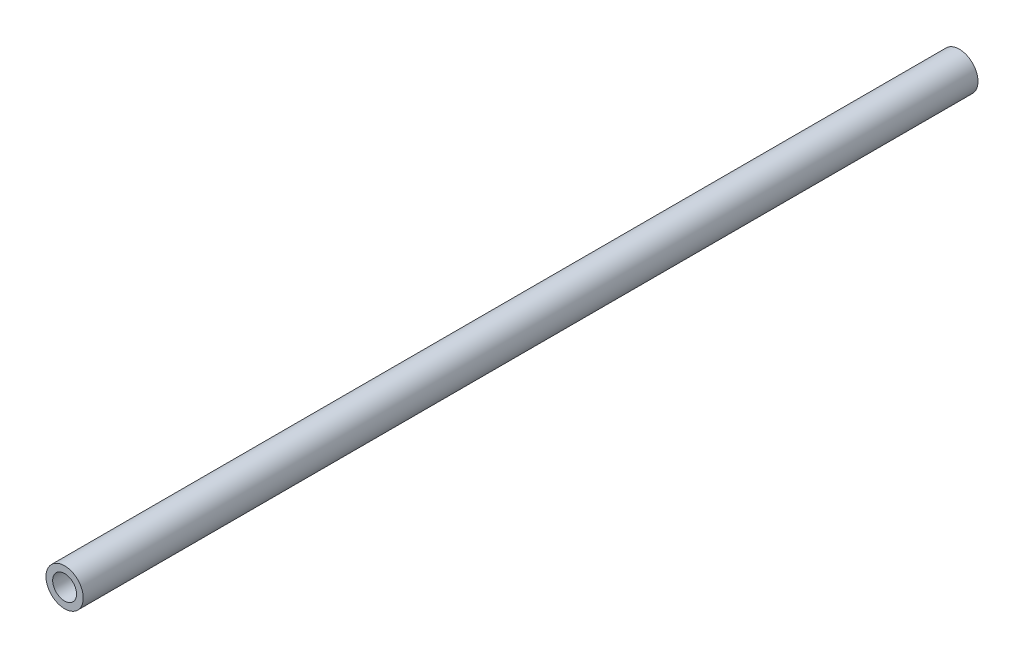
ISO-10303-21;
HEADER;
FILE_DESCRIPTION(('STEP AP214'),'2;1');
FILE_NAME('part.step','',(''),(''),'','','');
FILE_SCHEMA(('AUTOMOTIVE_DESIGN { 1 0 10303 214 1 1 1 1 }'));
ENDSEC;
DATA;
#1=APPLICATION_CONTEXT('core data for automotive mechanical design processes');
#2=APPLICATION_PROTOCOL_DEFINITION('international standard','automotive_design',2000,#1);
#3=PRODUCT_CONTEXT('',#1,'mechanical');
#4=PRODUCT('Part','Part','',(#3));
#5=PRODUCT_RELATED_PRODUCT_CATEGORY('part','',(#4));
#6=PRODUCT_DEFINITION_FORMATION('','',#4);
#7=PRODUCT_DEFINITION_CONTEXT('part definition',#1,'design');
#8=PRODUCT_DEFINITION('design','',#6,#7);
#9=PRODUCT_DEFINITION_SHAPE('','',#8);
#10=(LENGTH_UNIT() NAMED_UNIT(*) SI_UNIT(.MILLI.,.METRE.));
#11=(NAMED_UNIT(*) PLANE_ANGLE_UNIT() SI_UNIT($,.RADIAN.));
#12=(NAMED_UNIT(*) SI_UNIT($,.STERADIAN.) SOLID_ANGLE_UNIT());
#13=UNCERTAINTY_MEASURE_WITH_UNIT(LENGTH_MEASURE(1.E-05),#10,'distance_accuracy_value','');
#14=(GEOMETRIC_REPRESENTATION_CONTEXT(3) GLOBAL_UNCERTAINTY_ASSIGNED_CONTEXT((#13)) GLOBAL_UNIT_ASSIGNED_CONTEXT((#10,
#11,#12)) REPRESENTATION_CONTEXT('',''));
#15=CARTESIAN_POINT('',(0.,0.,0.));
#16=DIRECTION('',(0.,0.,1.));
#17=DIRECTION('',(1.,0.,0.));
#18=AXIS2_PLACEMENT_3D('',#15,#16,#17);
#19=CARTESIAN_POINT('',(0.,0.,60.));
#20=DIRECTION('',(0.,0.,1.));
#21=DIRECTION('',(1.,0.,0.));
#22=AXIS2_PLACEMENT_3D('',#19,#20,#21);
#23=PLANE('',#22);
#24=CARTESIAN_POINT('',(0.,0.,60.));
#25=DIRECTION('',(0.,0.,1.));
#26=DIRECTION('',(1.,0.,0.));
#27=AXIS2_PLACEMENT_3D('',#24,#25,#26);
#28=CIRCLE('',#27,2.5);
#29=CARTESIAN_POINT('',(2.5,0.,60.));
#30=VERTEX_POINT('',#29);
#31=EDGE_CURVE('E10',#30,#30,#28,.T.);
#32=ORIENTED_EDGE('',*,*,#31,.T.);
#33=EDGE_LOOP('',(#32));
#34=FACE_BOUND('',#33,.T.);
#35=CARTESIAN_POINT('',(0.,0.,60.));
#36=DIRECTION('',(0.,0.,1.));
#37=DIRECTION('',(1.,0.,0.));
#38=AXIS2_PLACEMENT_3D('',#35,#36,#37);
#39=CIRCLE('',#38,1.6);
#40=CARTESIAN_POINT('',(1.6,0.,60.));
#41=VERTEX_POINT('',#40);
#42=EDGE_CURVE('E43',#41,#41,#39,.T.);
#43=ORIENTED_EDGE('',*,*,#42,.F.);
#44=EDGE_LOOP('',(#43));
#45=FACE_BOUND('',#44,.T.);
#46=ADVANCED_FACE('F32',(#34,#45),#23,.T.);
#47=CARTESIAN_POINT('',(0.,0.,-60.));
#48=DIRECTION('',(0.,0.,1.));
#49=DIRECTION('',(1.,0.,0.));
#50=AXIS2_PLACEMENT_3D('',#47,#48,#49);
#51=PLANE('',#50);
#52=CARTESIAN_POINT('',(0.,0.,-60.));
#53=DIRECTION('',(0.,0.,1.));
#54=DIRECTION('',(1.,0.,0.));
#55=AXIS2_PLACEMENT_3D('',#52,#53,#54);
#56=CIRCLE('',#55,2.5);
#57=CARTESIAN_POINT('',(2.5,0.,-60.));
#58=VERTEX_POINT('',#57);
#59=EDGE_CURVE('E36',#58,#58,#56,.T.);
#60=ORIENTED_EDGE('',*,*,#59,.F.);
#61=EDGE_LOOP('',(#60));
#62=FACE_BOUND('',#61,.T.);
#63=CARTESIAN_POINT('',(0.,0.,-60.));
#64=DIRECTION('',(0.,0.,1.));
#65=DIRECTION('',(1.,0.,0.));
#66=AXIS2_PLACEMENT_3D('',#63,#64,#65);
#67=CIRCLE('',#66,1.6);
#68=CARTESIAN_POINT('',(1.6,0.,-60.));
#69=VERTEX_POINT('',#68);
#70=EDGE_CURVE('E45',#69,#69,#67,.T.);
#71=ORIENTED_EDGE('',*,*,#70,.T.);
#72=EDGE_LOOP('',(#71));
#73=FACE_BOUND('',#72,.T.);
#74=ADVANCED_FACE('F55',(#62,#73),#51,.F.);
#75=CARTESIAN_POINT('',(0.,0.,60.));
#76=DIRECTION('',(0.,0.,-1.));
#77=DIRECTION('',(-1.,0.,0.));
#78=AXIS2_PLACEMENT_3D('',#75,#76,#77);
#79=CYLINDRICAL_SURFACE('',#78,2.5);
#80=ORIENTED_EDGE('',*,*,#31,.F.);
#81=EDGE_LOOP('',(#80));
#82=FACE_BOUND('',#81,.T.);
#83=ORIENTED_EDGE('',*,*,#59,.T.);
#84=EDGE_LOOP('',(#83));
#85=FACE_BOUND('',#84,.T.);
#86=ADVANCED_FACE('F34',(#82,#85),#79,.T.);
#87=CARTESIAN_POINT('',(0.,0.,60.));
#88=DIRECTION('',(0.,0.,-1.));
#89=DIRECTION('',(-1.,0.,0.));
#90=AXIS2_PLACEMENT_3D('',#87,#88,#89);
#91=CYLINDRICAL_SURFACE('',#90,1.6);
#92=ORIENTED_EDGE('',*,*,#42,.T.);
#93=EDGE_LOOP('',(#92));
#94=FACE_BOUND('',#93,.T.);
#95=ORIENTED_EDGE('',*,*,#70,.F.);
#96=EDGE_LOOP('',(#95));
#97=FACE_BOUND('',#96,.T.);
#98=ADVANCED_FACE('F51',(#94,#97),#91,.F.);
#99=CLOSED_SHELL('',(#46,#74,#86,#98));
#100=MANIFOLD_SOLID_BREP('B2',#99);
#101=ADVANCED_BREP_SHAPE_REPRESENTATION('',(#18,#100),#14);
#102=SHAPE_DEFINITION_REPRESENTATION(#9,#101);
ENDSEC;
END-ISO-10303-21;
